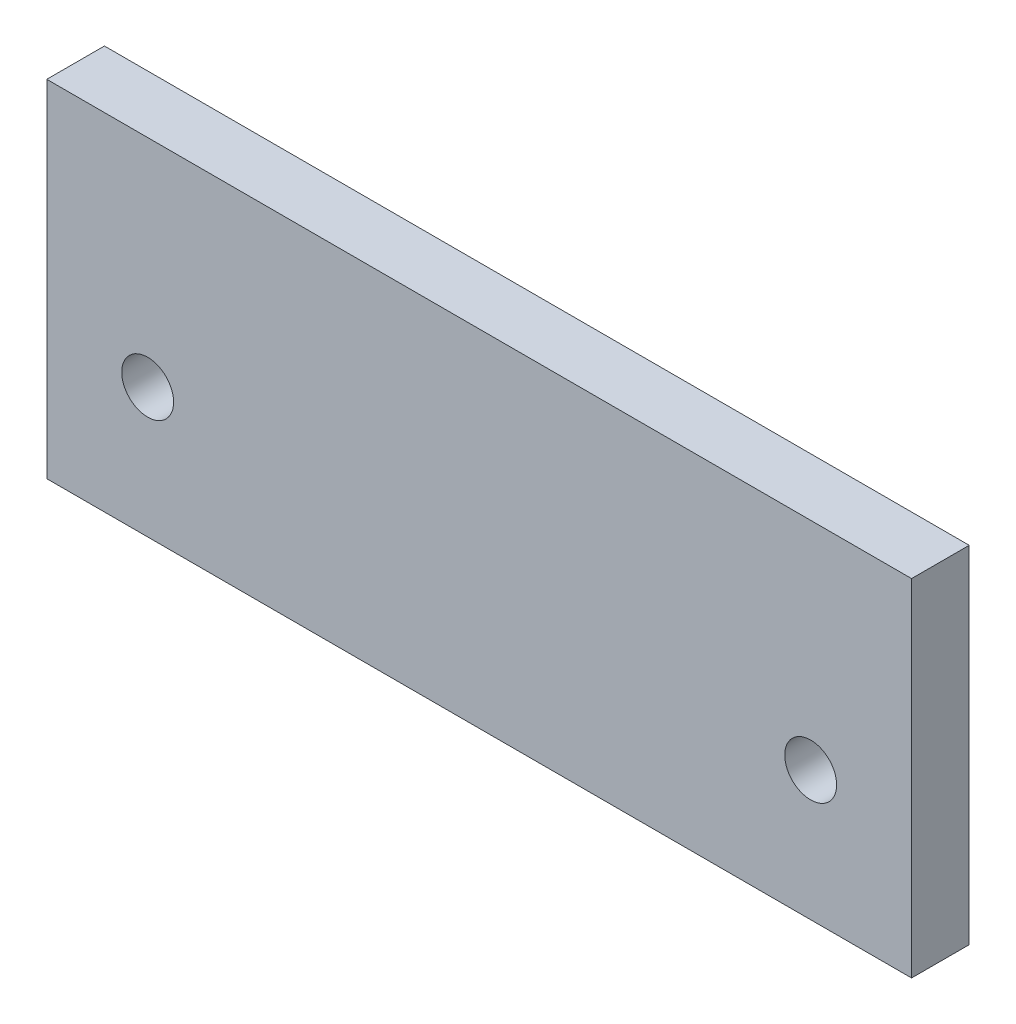
ISO-10303-21;
HEADER;
FILE_DESCRIPTION(('STEP AP214'),'2;1');
FILE_NAME('part.step','',(''),(''),'','','');
FILE_SCHEMA(('AUTOMOTIVE_DESIGN { 1 0 10303 214 1 1 1 1 }'));
ENDSEC;
DATA;
#1=APPLICATION_CONTEXT('core data for automotive mechanical design processes');
#2=APPLICATION_PROTOCOL_DEFINITION('international standard','automotive_design',2000,#1);
#3=PRODUCT_CONTEXT('',#1,'mechanical');
#4=PRODUCT('Part','Part','',(#3));
#5=PRODUCT_RELATED_PRODUCT_CATEGORY('part','',(#4));
#6=PRODUCT_DEFINITION_FORMATION('','',#4);
#7=PRODUCT_DEFINITION_CONTEXT('part definition',#1,'design');
#8=PRODUCT_DEFINITION('design','',#6,#7);
#9=PRODUCT_DEFINITION_SHAPE('','',#8);
#10=(LENGTH_UNIT() NAMED_UNIT(*) SI_UNIT(.MILLI.,.METRE.));
#11=(NAMED_UNIT(*) PLANE_ANGLE_UNIT() SI_UNIT($,.RADIAN.));
#12=(NAMED_UNIT(*) SI_UNIT($,.STERADIAN.) SOLID_ANGLE_UNIT());
#13=UNCERTAINTY_MEASURE_WITH_UNIT(LENGTH_MEASURE(1.E-05),#10,'distance_accuracy_value','');
#14=(GEOMETRIC_REPRESENTATION_CONTEXT(3) GLOBAL_UNCERTAINTY_ASSIGNED_CONTEXT((#13)) GLOBAL_UNIT_ASSIGNED_CONTEXT((#10,
#11,#12)) REPRESENTATION_CONTEXT('',''));
#15=CARTESIAN_POINT('',(0.,0.,0.));
#16=DIRECTION('',(0.,0.,1.));
#17=DIRECTION('',(1.,0.,0.));
#18=AXIS2_PLACEMENT_3D('',#15,#16,#17);
#19=CARTESIAN_POINT('',(0.,0.,20.));
#20=DIRECTION('',(1.,0.,0.));
#21=DIRECTION('',(0.,0.,-1.));
#22=AXIS2_PLACEMENT_3D('',#19,#20,#21);
#23=PLANE('',#22);
#24=DIRECTION('',(0.,-1.,0.));
#25=VECTOR('',#24,1.);
#26=CARTESIAN_POINT('',(0.,0.,0.));
#27=LINE('',#26,#25);
#28=CARTESIAN_POINT('',(0.,120.,0.));
#29=VERTEX_POINT('',#28);
#30=CARTESIAN_POINT('',(0.,0.,0.));
#31=VERTEX_POINT('',#30);
#32=EDGE_CURVE('E97',#29,#31,#27,.T.);
#33=ORIENTED_EDGE('',*,*,#32,.T.);
#34=DIRECTION('',(0.,0.,-1.));
#35=VECTOR('',#34,1.);
#36=CARTESIAN_POINT('',(0.,0.,20.));
#37=LINE('',#36,#35);
#38=CARTESIAN_POINT('',(0.,0.,20.));
#39=VERTEX_POINT('',#38);
#40=EDGE_CURVE('E11',#39,#31,#37,.T.);
#41=ORIENTED_EDGE('',*,*,#40,.F.);
#42=DIRECTION('',(0.,-1.,0.));
#43=VECTOR('',#42,1.);
#44=CARTESIAN_POINT('',(0.,0.,20.));
#45=LINE('',#44,#43);
#46=CARTESIAN_POINT('',(0.,120.,20.));
#47=VERTEX_POINT('',#46);
#48=EDGE_CURVE('E85',#47,#39,#45,.T.);
#49=ORIENTED_EDGE('',*,*,#48,.F.);
#50=DIRECTION('',(0.,0.,-1.));
#51=VECTOR('',#50,1.);
#52=CARTESIAN_POINT('',(0.,120.,20.));
#53=LINE('',#52,#51);
#54=EDGE_CURVE('E93',#47,#29,#53,.T.);
#55=ORIENTED_EDGE('',*,*,#54,.T.);
#56=EDGE_LOOP('',(#33,#41,#49,#55));
#57=FACE_BOUND('',#56,.T.);
#58=ADVANCED_FACE('F34',(#57),#23,.F.);
#59=CARTESIAN_POINT('',(0.,0.,20.));
#60=DIRECTION('',(0.,1.,0.));
#61=DIRECTION('',(0.,0.,1.));
#62=AXIS2_PLACEMENT_3D('',#59,#60,#61);
#63=PLANE('',#62);
#64=DIRECTION('',(1.,0.,0.));
#65=VECTOR('',#64,1.);
#66=CARTESIAN_POINT('',(0.,0.,0.));
#67=LINE('',#66,#65);
#68=CARTESIAN_POINT('',(300.,0.,0.));
#69=VERTEX_POINT('',#68);
#70=EDGE_CURVE('E89',#31,#69,#67,.T.);
#71=ORIENTED_EDGE('',*,*,#70,.T.);
#72=DIRECTION('',(0.,0.,-1.));
#73=VECTOR('',#72,1.);
#74=CARTESIAN_POINT('',(300.,0.,20.));
#75=LINE('',#74,#73);
#76=CARTESIAN_POINT('',(300.,0.,20.));
#77=VERTEX_POINT('',#76);
#78=EDGE_CURVE('E42',#77,#69,#75,.T.);
#79=ORIENTED_EDGE('',*,*,#78,.F.);
#80=DIRECTION('',(1.,0.,0.));
#81=VECTOR('',#80,1.);
#82=CARTESIAN_POINT('',(0.,0.,20.));
#83=LINE('',#82,#81);
#84=EDGE_CURVE('E80',#39,#77,#83,.T.);
#85=ORIENTED_EDGE('',*,*,#84,.F.);
#86=ORIENTED_EDGE('',*,*,#40,.T.);
#87=EDGE_LOOP('',(#71,#79,#85,#86));
#88=FACE_BOUND('',#87,.T.);
#89=ADVANCED_FACE('F88',(#88),#63,.F.);
#90=CARTESIAN_POINT('',(300.,0.,20.));
#91=DIRECTION('',(-1.,0.,0.));
#92=DIRECTION('',(0.,0.,1.));
#93=AXIS2_PLACEMENT_3D('',#90,#91,#92);
#94=PLANE('',#93);
#95=DIRECTION('',(0.,1.,0.));
#96=VECTOR('',#95,1.);
#97=CARTESIAN_POINT('',(300.,0.,0.));
#98=LINE('',#97,#96);
#99=CARTESIAN_POINT('',(300.,120.,0.));
#100=VERTEX_POINT('',#99);
#101=EDGE_CURVE('E67',#69,#100,#98,.T.);
#102=ORIENTED_EDGE('',*,*,#101,.T.);
#103=DIRECTION('',(0.,0.,-1.));
#104=VECTOR('',#103,1.);
#105=CARTESIAN_POINT('',(300.,120.,20.));
#106=LINE('',#105,#104);
#107=CARTESIAN_POINT('',(300.,120.,20.));
#108=VERTEX_POINT('',#107);
#109=EDGE_CURVE('E90',#108,#100,#106,.T.);
#110=ORIENTED_EDGE('',*,*,#109,.F.);
#111=DIRECTION('',(0.,1.,0.));
#112=VECTOR('',#111,1.);
#113=CARTESIAN_POINT('',(300.,0.,20.));
#114=LINE('',#113,#112);
#115=EDGE_CURVE('E83',#77,#108,#114,.T.);
#116=ORIENTED_EDGE('',*,*,#115,.F.);
#117=ORIENTED_EDGE('',*,*,#78,.T.);
#118=EDGE_LOOP('',(#102,#110,#116,#117));
#119=FACE_BOUND('',#118,.T.);
#120=ADVANCED_FACE('F91',(#119),#94,.F.);
#121=CARTESIAN_POINT('',(0.,120.,20.));
#122=DIRECTION('',(0.,-1.,0.));
#123=DIRECTION('',(0.,0.,-1.));
#124=AXIS2_PLACEMENT_3D('',#121,#122,#123);
#125=PLANE('',#124);
#126=DIRECTION('',(-1.,0.,0.));
#127=VECTOR('',#126,1.);
#128=CARTESIAN_POINT('',(0.,120.,0.));
#129=LINE('',#128,#127);
#130=EDGE_CURVE('E73',#100,#29,#129,.T.);
#131=ORIENTED_EDGE('',*,*,#130,.T.);
#132=ORIENTED_EDGE('',*,*,#54,.F.);
#133=DIRECTION('',(-1.,0.,0.));
#134=VECTOR('',#133,1.);
#135=CARTESIAN_POINT('',(0.,120.,20.));
#136=LINE('',#135,#134);
#137=EDGE_CURVE('E50',#108,#47,#136,.T.);
#138=ORIENTED_EDGE('',*,*,#137,.F.);
#139=ORIENTED_EDGE('',*,*,#109,.T.);
#140=EDGE_LOOP('',(#131,#132,#138,#139));
#141=FACE_BOUND('',#140,.T.);
#142=ADVANCED_FACE('F105',(#141),#125,.F.);
#143=CARTESIAN_POINT('',(0.,0.,20.));
#144=DIRECTION('',(0.,0.,-1.));
#145=DIRECTION('',(-1.,0.,0.));
#146=AXIS2_PLACEMENT_3D('',#143,#144,#145);
#147=PLANE('',#146);
#148=CARTESIAN_POINT('',(35.,45.,20.));
#149=DIRECTION('',(0.,0.,1.));
#150=DIRECTION('',(1.,0.,0.));
#151=AXIS2_PLACEMENT_3D('',#148,#149,#150);
#152=CIRCLE('',#151,9.00000000000002);
#153=CARTESIAN_POINT('',(44.,45.,20.));
#154=VERTEX_POINT('',#153);
#155=EDGE_CURVE('E117',#154,#154,#152,.T.);
#156=ORIENTED_EDGE('',*,*,#155,.F.);
#157=EDGE_LOOP('',(#156));
#158=FACE_BOUND('',#157,.T.);
#159=CARTESIAN_POINT('',(265.,44.9999999999999,20.));
#160=DIRECTION('',(0.,0.,1.));
#161=DIRECTION('',(1.,0.,0.));
#162=AXIS2_PLACEMENT_3D('',#159,#160,#161);
#163=CIRCLE('',#162,8.99999999999998);
#164=CARTESIAN_POINT('',(274.,44.9999999999999,20.));
#165=VERTEX_POINT('',#164);
#166=EDGE_CURVE('E111',#165,#165,#163,.T.);
#167=ORIENTED_EDGE('',*,*,#166,.F.);
#168=EDGE_LOOP('',(#167));
#169=FACE_BOUND('',#168,.T.);
#170=ORIENTED_EDGE('',*,*,#48,.T.);
#171=ORIENTED_EDGE('',*,*,#84,.T.);
#172=ORIENTED_EDGE('',*,*,#115,.T.);
#173=ORIENTED_EDGE('',*,*,#137,.T.);
#174=EDGE_LOOP('',(#170,#171,#172,#173));
#175=FACE_BOUND('',#174,.T.);
#176=ADVANCED_FACE('F81',(#158,#169,#175),#147,.F.);
#177=CARTESIAN_POINT('',(0.,0.,0.));
#178=DIRECTION('',(0.,0.,-1.));
#179=DIRECTION('',(-1.,0.,0.));
#180=AXIS2_PLACEMENT_3D('',#177,#178,#179);
#181=PLANE('',#180);
#182=CARTESIAN_POINT('',(35.,45.,0.));
#183=DIRECTION('',(0.,0.,1.));
#184=DIRECTION('',(1.,0.,0.));
#185=AXIS2_PLACEMENT_3D('',#182,#183,#184);
#186=CIRCLE('',#185,9.00000000000002);
#187=CARTESIAN_POINT('',(44.,45.,0.));
#188=VERTEX_POINT('',#187);
#189=EDGE_CURVE('E114',#188,#188,#186,.T.);
#190=ORIENTED_EDGE('',*,*,#189,.T.);
#191=EDGE_LOOP('',(#190));
#192=FACE_BOUND('',#191,.T.);
#193=CARTESIAN_POINT('',(265.,44.9999999999999,0.));
#194=DIRECTION('',(0.,0.,1.));
#195=DIRECTION('',(1.,0.,0.));
#196=AXIS2_PLACEMENT_3D('',#193,#194,#195);
#197=CIRCLE('',#196,8.99999999999998);
#198=CARTESIAN_POINT('',(274.,44.9999999999999,0.));
#199=VERTEX_POINT('',#198);
#200=EDGE_CURVE('E100',#199,#199,#197,.T.);
#201=ORIENTED_EDGE('',*,*,#200,.T.);
#202=EDGE_LOOP('',(#201));
#203=FACE_BOUND('',#202,.T.);
#204=ORIENTED_EDGE('',*,*,#32,.F.);
#205=ORIENTED_EDGE('',*,*,#130,.F.);
#206=ORIENTED_EDGE('',*,*,#101,.F.);
#207=ORIENTED_EDGE('',*,*,#70,.F.);
#208=EDGE_LOOP('',(#204,#205,#206,#207));
#209=FACE_BOUND('',#208,.T.);
#210=ADVANCED_FACE('F108',(#192,#203,#209),#181,.T.);
#211=CARTESIAN_POINT('',(265.,44.9999999999999,0.));
#212=DIRECTION('',(0.,0.,1.));
#213=DIRECTION('',(1.,0.,0.));
#214=AXIS2_PLACEMENT_3D('',#211,#212,#213);
#215=CYLINDRICAL_SURFACE('',#214,8.99999999999998);
#216=ORIENTED_EDGE('',*,*,#200,.F.);
#217=EDGE_LOOP('',(#216));
#218=FACE_BOUND('',#217,.T.);
#219=ORIENTED_EDGE('',*,*,#166,.T.);
#220=EDGE_LOOP('',(#219));
#221=FACE_BOUND('',#220,.T.);
#222=ADVANCED_FACE('F128',(#218,#221),#215,.F.);
#223=CARTESIAN_POINT('',(35.,45.,0.));
#224=DIRECTION('',(0.,0.,1.));
#225=DIRECTION('',(1.,0.,0.));
#226=AXIS2_PLACEMENT_3D('',#223,#224,#225);
#227=CYLINDRICAL_SURFACE('',#226,9.00000000000002);
#228=ORIENTED_EDGE('',*,*,#189,.F.);
#229=EDGE_LOOP('',(#228));
#230=FACE_BOUND('',#229,.T.);
#231=ORIENTED_EDGE('',*,*,#155,.T.);
#232=EDGE_LOOP('',(#231));
#233=FACE_BOUND('',#232,.T.);
#234=ADVANCED_FACE('F125',(#230,#233),#227,.F.);
#235=CLOSED_SHELL('',(#58,#89,#120,#142,#176,#210,#222,#234));
#236=MANIFOLD_SOLID_BREP('B2',#235);
#237=ADVANCED_BREP_SHAPE_REPRESENTATION('',(#18,#236),#14);
#238=SHAPE_DEFINITION_REPRESENTATION(#9,#237);
ENDSEC;
END-ISO-10303-21;
